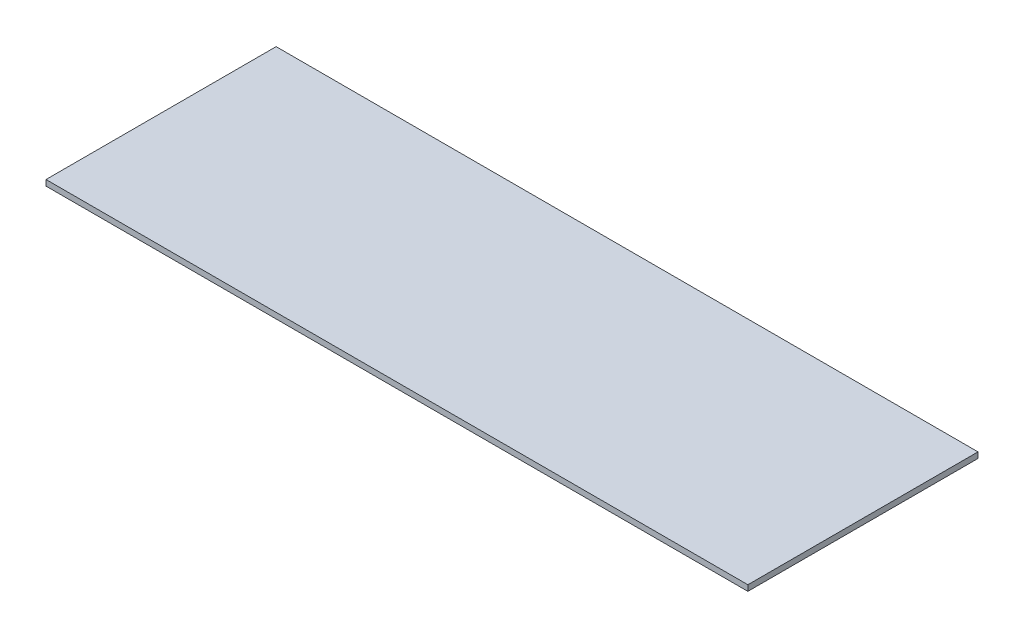
ISO-10303-21;
HEADER;
FILE_DESCRIPTION(('STEP AP214'),'2;1');
FILE_NAME('part.step','',(''),(''),'','','');
FILE_SCHEMA(('AUTOMOTIVE_DESIGN { 1 0 10303 214 1 1 1 1 }'));
ENDSEC;
DATA;
#1=APPLICATION_CONTEXT('core data for automotive mechanical design processes');
#2=APPLICATION_PROTOCOL_DEFINITION('international standard','automotive_design',2000,#1);
#3=PRODUCT_CONTEXT('',#1,'mechanical');
#4=PRODUCT('Part','Part','',(#3));
#5=PRODUCT_RELATED_PRODUCT_CATEGORY('part','',(#4));
#6=PRODUCT_DEFINITION_FORMATION('','',#4);
#7=PRODUCT_DEFINITION_CONTEXT('part definition',#1,'design');
#8=PRODUCT_DEFINITION('design','',#6,#7);
#9=PRODUCT_DEFINITION_SHAPE('','',#8);
#10=(LENGTH_UNIT() NAMED_UNIT(*) SI_UNIT(.MILLI.,.METRE.));
#11=(NAMED_UNIT(*) PLANE_ANGLE_UNIT() SI_UNIT($,.RADIAN.));
#12=(NAMED_UNIT(*) SI_UNIT($,.STERADIAN.) SOLID_ANGLE_UNIT());
#13=UNCERTAINTY_MEASURE_WITH_UNIT(LENGTH_MEASURE(1.E-05),#10,'distance_accuracy_value','');
#14=(GEOMETRIC_REPRESENTATION_CONTEXT(3) GLOBAL_UNCERTAINTY_ASSIGNED_CONTEXT((#13)) GLOBAL_UNIT_ASSIGNED_CONTEXT((#10,
#11,#12)) REPRESENTATION_CONTEXT('',''));
#15=CARTESIAN_POINT('',(0.,0.,0.));
#16=DIRECTION('',(0.,0.,1.));
#17=DIRECTION('',(1.,0.,0.));
#18=AXIS2_PLACEMENT_3D('',#15,#16,#17);
#19=CARTESIAN_POINT('',(-73.2021862544537,10.,-369.585007119628));
#20=DIRECTION('',(0.,0.,-1.));
#21=DIRECTION('',(-1.,0.,0.));
#22=AXIS2_PLACEMENT_3D('',#19,#20,#21);
#23=PLANE('',#22);
#24=DIRECTION('',(1.,0.,0.));
#25=VECTOR('',#24,1.);
#26=CARTESIAN_POINT('',(-73.2021862544537,0.,-369.585007119628));
#27=LINE('',#26,#25);
#28=CARTESIAN_POINT('',(-73.2021862544537,0.,-369.585007119628));
#29=VERTEX_POINT('',#28);
#30=CARTESIAN_POINT('',(1146.79781374555,0.,-369.585007119628));
#31=VERTEX_POINT('',#30);
#32=EDGE_CURVE('E97',#29,#31,#27,.T.);
#33=ORIENTED_EDGE('',*,*,#32,.F.);
#34=DIRECTION('',(0.,-1.,0.));
#35=VECTOR('',#34,1.);
#36=CARTESIAN_POINT('',(-73.2021862544537,10.,-369.585007119628));
#37=LINE('',#36,#35);
#38=CARTESIAN_POINT('',(-73.2021862544537,10.,-369.585007119628));
#39=VERTEX_POINT('',#38);
#40=EDGE_CURVE('E11',#39,#29,#37,.T.);
#41=ORIENTED_EDGE('',*,*,#40,.F.);
#42=DIRECTION('',(1.,0.,0.));
#43=VECTOR('',#42,1.);
#44=CARTESIAN_POINT('',(-73.2021862544537,10.,-369.585007119628));
#45=LINE('',#44,#43);
#46=CARTESIAN_POINT('',(1146.79781374555,10.,-369.585007119628));
#47=VERTEX_POINT('',#46);
#48=EDGE_CURVE('E92',#39,#47,#45,.T.);
#49=ORIENTED_EDGE('',*,*,#48,.T.);
#50=DIRECTION('',(0.,-1.,0.));
#51=VECTOR('',#50,1.);
#52=CARTESIAN_POINT('',(1146.79781374555,10.,-369.585007119628));
#53=LINE('',#52,#51);
#54=EDGE_CURVE('E35',#47,#31,#53,.T.);
#55=ORIENTED_EDGE('',*,*,#54,.T.);
#56=EDGE_LOOP('',(#33,#41,#49,#55));
#57=FACE_BOUND('',#56,.T.);
#58=ADVANCED_FACE('F32',(#57),#23,.T.);
#59=CARTESIAN_POINT('',(-73.2021862544537,10.,-369.585007119628));
#60=DIRECTION('',(1.,0.,0.));
#61=DIRECTION('',(0.,0.,-1.));
#62=AXIS2_PLACEMENT_3D('',#59,#60,#61);
#63=PLANE('',#62);
#64=DIRECTION('',(0.,0.,1.));
#65=VECTOR('',#64,1.);
#66=CARTESIAN_POINT('',(-73.2021862544537,0.,-369.585007119628));
#67=LINE('',#66,#65);
#68=CARTESIAN_POINT('',(-73.2021862544537,0.,30.4149928803716));
#69=VERTEX_POINT('',#68);
#70=EDGE_CURVE('E65',#29,#69,#67,.T.);
#71=ORIENTED_EDGE('',*,*,#70,.T.);
#72=DIRECTION('',(0.,-1.,0.));
#73=VECTOR('',#72,1.);
#74=CARTESIAN_POINT('',(-73.2021862544537,10.,30.4149928803716));
#75=LINE('',#74,#73);
#76=CARTESIAN_POINT('',(-73.2021862544537,10.,30.4149928803716));
#77=VERTEX_POINT('',#76);
#78=EDGE_CURVE('E41',#77,#69,#75,.T.);
#79=ORIENTED_EDGE('',*,*,#78,.F.);
#80=DIRECTION('',(0.,0.,1.));
#81=VECTOR('',#80,1.);
#82=CARTESIAN_POINT('',(-73.2021862544537,10.,-369.585007119628));
#83=LINE('',#82,#81);
#84=EDGE_CURVE('E82',#39,#77,#83,.T.);
#85=ORIENTED_EDGE('',*,*,#84,.F.);
#86=ORIENTED_EDGE('',*,*,#40,.T.);
#87=EDGE_LOOP('',(#71,#79,#85,#86));
#88=FACE_BOUND('',#87,.T.);
#89=ADVANCED_FACE('F107',(#88),#63,.F.);
#90=CARTESIAN_POINT('',(-73.2021862544537,10.,30.4149928803716));
#91=DIRECTION('',(0.,0.,-1.));
#92=DIRECTION('',(-1.,0.,0.));
#93=AXIS2_PLACEMENT_3D('',#90,#91,#92);
#94=PLANE('',#93);
#95=DIRECTION('',(1.,0.,0.));
#96=VECTOR('',#95,1.);
#97=CARTESIAN_POINT('',(-73.2021862544537,0.,30.4149928803716));
#98=LINE('',#97,#96);
#99=CARTESIAN_POINT('',(1146.79781374555,0.,30.4149928803716));
#100=VERTEX_POINT('',#99);
#101=EDGE_CURVE('E89',#69,#100,#98,.T.);
#102=ORIENTED_EDGE('',*,*,#101,.T.);
#103=DIRECTION('',(0.,-1.,0.));
#104=VECTOR('',#103,1.);
#105=CARTESIAN_POINT('',(1146.79781374555,10.,30.4149928803716));
#106=LINE('',#105,#104);
#107=CARTESIAN_POINT('',(1146.79781374555,10.,30.4149928803716));
#108=VERTEX_POINT('',#107);
#109=EDGE_CURVE('E86',#108,#100,#106,.T.);
#110=ORIENTED_EDGE('',*,*,#109,.F.);
#111=DIRECTION('',(1.,0.,0.));
#112=VECTOR('',#111,1.);
#113=CARTESIAN_POINT('',(-73.2021862544537,10.,30.4149928803716));
#114=LINE('',#113,#112);
#115=EDGE_CURVE('E77',#77,#108,#114,.T.);
#116=ORIENTED_EDGE('',*,*,#115,.F.);
#117=ORIENTED_EDGE('',*,*,#78,.T.);
#118=EDGE_LOOP('',(#102,#110,#116,#117));
#119=FACE_BOUND('',#118,.T.);
#120=ADVANCED_FACE('F87',(#119),#94,.F.);
#121=CARTESIAN_POINT('',(1146.79781374555,10.,-369.585007119628));
#122=DIRECTION('',(1.,0.,0.));
#123=DIRECTION('',(0.,0.,-1.));
#124=AXIS2_PLACEMENT_3D('',#121,#122,#123);
#125=PLANE('',#124);
#126=DIRECTION('',(0.,0.,1.));
#127=VECTOR('',#126,1.);
#128=CARTESIAN_POINT('',(1146.79781374555,0.,-369.585007119628));
#129=LINE('',#128,#127);
#130=EDGE_CURVE('E100',#31,#100,#129,.T.);
#131=ORIENTED_EDGE('',*,*,#130,.F.);
#132=ORIENTED_EDGE('',*,*,#54,.F.);
#133=DIRECTION('',(0.,0.,1.));
#134=VECTOR('',#133,1.);
#135=CARTESIAN_POINT('',(1146.79781374555,10.,-369.585007119628));
#136=LINE('',#135,#134);
#137=EDGE_CURVE('E81',#47,#108,#136,.T.);
#138=ORIENTED_EDGE('',*,*,#137,.T.);
#139=ORIENTED_EDGE('',*,*,#109,.T.);
#140=EDGE_LOOP('',(#131,#132,#138,#139));
#141=FACE_BOUND('',#140,.T.);
#142=ADVANCED_FACE('F91',(#141),#125,.T.);
#143=CARTESIAN_POINT('',(0.,10.,0.));
#144=DIRECTION('',(0.,-1.,0.));
#145=DIRECTION('',(0.,0.,-1.));
#146=AXIS2_PLACEMENT_3D('',#143,#144,#145);
#147=PLANE('',#146);
#148=ORIENTED_EDGE('',*,*,#48,.F.);
#149=ORIENTED_EDGE('',*,*,#84,.T.);
#150=ORIENTED_EDGE('',*,*,#115,.T.);
#151=ORIENTED_EDGE('',*,*,#137,.F.);
#152=EDGE_LOOP('',(#148,#149,#150,#151));
#153=FACE_BOUND('',#152,.T.);
#154=ADVANCED_FACE('F80',(#153),#147,.F.);
#155=CARTESIAN_POINT('',(0.,0.,0.));
#156=DIRECTION('',(0.,-1.,0.));
#157=DIRECTION('',(0.,0.,-1.));
#158=AXIS2_PLACEMENT_3D('',#155,#156,#157);
#159=PLANE('',#158);
#160=ORIENTED_EDGE('',*,*,#32,.T.);
#161=ORIENTED_EDGE('',*,*,#130,.T.);
#162=ORIENTED_EDGE('',*,*,#101,.F.);
#163=ORIENTED_EDGE('',*,*,#70,.F.);
#164=EDGE_LOOP('',(#160,#161,#162,#163));
#165=FACE_BOUND('',#164,.T.);
#166=ADVANCED_FACE('F105',(#165),#159,.T.);
#167=CLOSED_SHELL('',(#58,#89,#120,#142,#154,#166));
#168=MANIFOLD_SOLID_BREP('B2',#167);
#169=ADVANCED_BREP_SHAPE_REPRESENTATION('',(#18,#168),#14);
#170=SHAPE_DEFINITION_REPRESENTATION(#9,#169);
ENDSEC;
END-ISO-10303-21;
